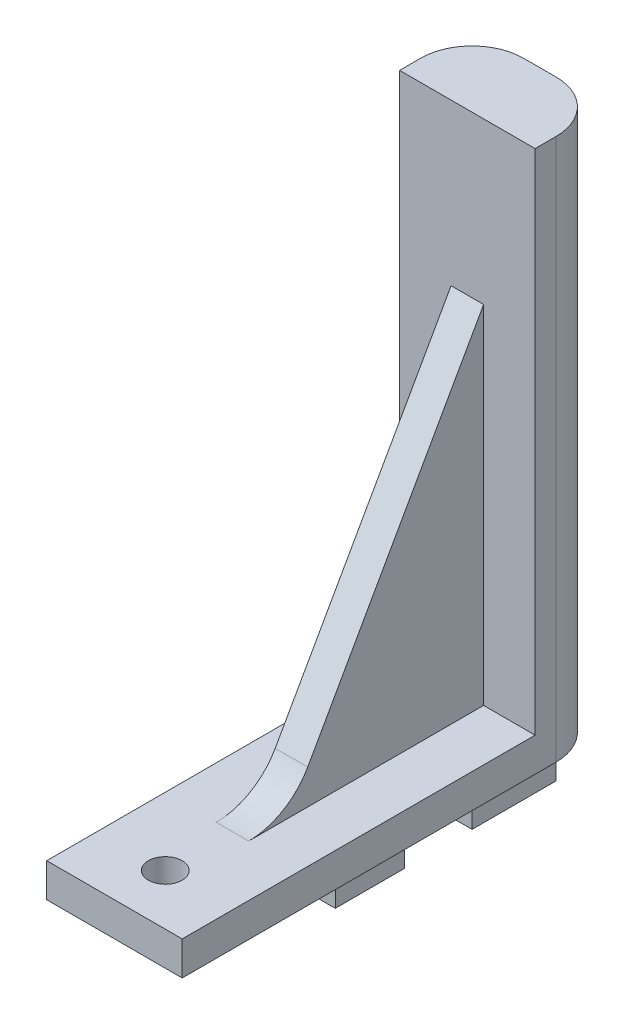
ISO-10303-21;
HEADER;
FILE_DESCRIPTION(('STEP AP214'),'2;1');
FILE_NAME('part.step','',(''),(''),'','','');
FILE_SCHEMA(('AUTOMOTIVE_DESIGN { 1 0 10303 214 1 1 1 1 }'));
ENDSEC;
DATA;
#1=APPLICATION_CONTEXT('core data for automotive mechanical design processes');
#2=APPLICATION_PROTOCOL_DEFINITION('international standard','automotive_design',2000,#1);
#3=PRODUCT_CONTEXT('',#1,'mechanical');
#4=PRODUCT('Part','Part','',(#3));
#5=PRODUCT_RELATED_PRODUCT_CATEGORY('part','',(#4));
#6=PRODUCT_DEFINITION_FORMATION('','',#4);
#7=PRODUCT_DEFINITION_CONTEXT('part definition',#1,'design');
#8=PRODUCT_DEFINITION('design','',#6,#7);
#9=PRODUCT_DEFINITION_SHAPE('','',#8);
#10=(LENGTH_UNIT() NAMED_UNIT(*) SI_UNIT(.MILLI.,.METRE.));
#11=(NAMED_UNIT(*) PLANE_ANGLE_UNIT() SI_UNIT($,.RADIAN.));
#12=(NAMED_UNIT(*) SI_UNIT($,.STERADIAN.) SOLID_ANGLE_UNIT());
#13=UNCERTAINTY_MEASURE_WITH_UNIT(LENGTH_MEASURE(1.E-05),#10,'distance_accuracy_value','');
#14=(GEOMETRIC_REPRESENTATION_CONTEXT(3) GLOBAL_UNCERTAINTY_ASSIGNED_CONTEXT((#13)) GLOBAL_UNIT_ASSIGNED_CONTEXT((#10,
#11,#12)) REPRESENTATION_CONTEXT('',''));
#15=CARTESIAN_POINT('',(0.,0.,0.));
#16=DIRECTION('',(0.,0.,1.));
#17=DIRECTION('',(1.,0.,0.));
#18=AXIS2_PLACEMENT_3D('',#15,#16,#17);
#19=CARTESIAN_POINT('',(6.35,2.97112168207122,5.28199410145995));
#20=DIRECTION('',(0.,-0.490261239632559,-0.871575537124549));
#21=DIRECTION('',(0.,0.871575537124549,-0.490261239632559));
#22=AXIS2_PLACEMENT_3D('',#19,#20,#21);
#23=PLANE('',#22);
#24=DIRECTION('',(0.,0.871575537124549,-0.490261239632559));
#25=VECTOR('',#24,1.);
#26=CARTESIAN_POINT('',(-1.524,2.97112168207122,5.28199410145995));
#27=LINE('',#26,#25);
#28=CARTESIAN_POINT('',(-1.524,6.41184112833326,3.34658941293755));
#29=VERTEX_POINT('',#28);
#30=CARTESIAN_POINT('',(-1.524,35.729333418,-13.1445));
#31=VERTEX_POINT('',#30);
#32=EDGE_CURVE('E213',#29,#31,#27,.T.);
#33=ORIENTED_EDGE('',*,*,#32,.F.);
#34=DIRECTION('',(-1.,0.,0.));
#35=VECTOR('',#34,1.);
#36=CARTESIAN_POINT('',(6.35,6.41184112833326,3.34658941293755));
#37=LINE('',#36,#35);
#38=CARTESIAN_POINT('',(1.524,6.41184112833326,3.34658941293755));
#39=VERTEX_POINT('',#38);
#40=EDGE_CURVE('E325',#29,#39,#37,.F.);
#41=ORIENTED_EDGE('',*,*,#40,.T.);
#42=DIRECTION('',(0.,0.871575537124549,-0.490261239632559));
#43=VECTOR('',#42,1.);
#44=CARTESIAN_POINT('',(1.524,2.97112168207122,5.28199410145995));
#45=LINE('',#44,#43);
#46=CARTESIAN_POINT('',(1.524,35.729333418,-13.1445));
#47=VERTEX_POINT('',#46);
#48=EDGE_CURVE('E54',#39,#47,#45,.T.);
#49=ORIENTED_EDGE('',*,*,#48,.T.);
#50=DIRECTION('',(-1.,0.,0.));
#51=VECTOR('',#50,1.);
#52=CARTESIAN_POINT('',(6.35,35.729333418,-13.1445));
#53=LINE('',#52,#51);
#54=EDGE_CURVE('E301',#47,#31,#53,.T.);
#55=ORIENTED_EDGE('',*,*,#54,.T.);
#56=EDGE_LOOP('',(#33,#41,#49,#55));
#57=FACE_BOUND('',#56,.T.);
#58=ADVANCED_FACE('F39',(#57),#23,.F.);
#59=CARTESIAN_POINT('',(-6.35,0.,0.));
#60=DIRECTION('',(1.,0.,0.));
#61=DIRECTION('',(0.,0.,-1.));
#62=AXIS2_PLACEMENT_3D('',#59,#60,#61);
#63=PLANE('',#62);
#64=DIRECTION('',(0.,0.,1.));
#65=VECTOR('',#64,1.);
#66=CARTESIAN_POINT('',(-6.35,3.17500000000002,0.));
#67=LINE('',#66,#65);
#68=CARTESIAN_POINT('',(-6.35,3.17500000000003,-13.1445));
#69=VERTEX_POINT('',#68);
#70=CARTESIAN_POINT('',(-6.35,3.175,19.939));
#71=VERTEX_POINT('',#70);
#72=EDGE_CURVE('E183',#69,#71,#67,.T.);
#73=ORIENTED_EDGE('',*,*,#72,.F.);
#74=DIRECTION('',(0.,1.,0.));
#75=VECTOR('',#74,1.);
#76=CARTESIAN_POINT('',(-6.35,0.,-13.1445));
#77=LINE('',#76,#75);
#78=CARTESIAN_POINT('',(-6.35,50.8,-13.1445));
#79=VERTEX_POINT('',#78);
#80=EDGE_CURVE('E171',#69,#79,#77,.T.);
#81=ORIENTED_EDGE('',*,*,#80,.T.);
#82=DIRECTION('',(0.,0.,1.));
#83=VECTOR('',#82,1.);
#84=CARTESIAN_POINT('',(-6.35,50.8,0.));
#85=LINE('',#84,#83);
#86=CARTESIAN_POINT('',(-6.35,50.8,-15.113));
#87=VERTEX_POINT('',#86);
#88=EDGE_CURVE('E279',#87,#79,#85,.T.);
#89=ORIENTED_EDGE('',*,*,#88,.F.);
#90=DIRECTION('',(0.,1.,0.));
#91=VECTOR('',#90,1.);
#92=CARTESIAN_POINT('',(-6.35,0.,-15.113));
#93=LINE('',#92,#91);
#94=CARTESIAN_POINT('',(-6.35,0.,-15.113));
#95=VERTEX_POINT('',#94);
#96=EDGE_CURVE('E315',#87,#95,#93,.F.);
#97=ORIENTED_EDGE('',*,*,#96,.T.);
#98=DIRECTION('',(0.,0.,-1.));
#99=VECTOR('',#98,1.);
#100=CARTESIAN_POINT('',(-6.35,0.,0.));
#101=LINE('',#100,#99);
#102=CARTESIAN_POINT('',(-6.35,0.,19.939));
#103=VERTEX_POINT('',#102);
#104=EDGE_CURVE('E289',#103,#95,#101,.T.);
#105=ORIENTED_EDGE('',*,*,#104,.F.);
#106=DIRECTION('',(0.,1.,0.));
#107=VECTOR('',#106,1.);
#108=CARTESIAN_POINT('',(-6.35,0.,19.939));
#109=LINE('',#108,#107);
#110=EDGE_CURVE('E191',#103,#71,#109,.T.);
#111=ORIENTED_EDGE('',*,*,#110,.T.);
#112=EDGE_LOOP('',(#73,#81,#89,#97,#105,#111));
#113=FACE_BOUND('',#112,.T.);
#114=ADVANCED_FACE('F188',(#113),#63,.F.);
#115=CARTESIAN_POINT('',(6.35,9.52500000000001,8.88109407367843));
#116=DIRECTION('',(1.,0.,0.));
#117=DIRECTION('',(0.,0.,-1.));
#118=AXIS2_PLACEMENT_3D('',#115,#116,#117);
#119=CYLINDRICAL_SURFACE('',#118,6.35);
#120=CARTESIAN_POINT('',(-1.524,9.52500000000001,8.88109407367843));
#121=DIRECTION('',(-1.,0.,0.));
#122=DIRECTION('',(0.,0.,1.));
#123=AXIS2_PLACEMENT_3D('',#120,#121,#122);
#124=CIRCLE('',#123,6.35);
#125=CARTESIAN_POINT('',(-1.524,3.17500000000001,8.88109407367843));
#126=VERTEX_POINT('',#125);
#127=EDGE_CURVE('E11',#126,#29,#124,.F.);
#128=ORIENTED_EDGE('',*,*,#127,.F.);
#129=DIRECTION('',(-1.,0.,0.));
#130=VECTOR('',#129,1.);
#131=CARTESIAN_POINT('',(-6.35,3.17500000000001,8.88109407367843));
#132=LINE('',#131,#130);
#133=CARTESIAN_POINT('',(1.524,3.17500000000001,8.88109407367843));
#134=VERTEX_POINT('',#133);
#135=EDGE_CURVE('E323',#134,#126,#132,.T.);
#136=ORIENTED_EDGE('',*,*,#135,.F.);
#137=CARTESIAN_POINT('',(1.524,9.52500000000001,8.88109407367843));
#138=DIRECTION('',(-1.,0.,0.));
#139=DIRECTION('',(0.,0.,1.));
#140=AXIS2_PLACEMENT_3D('',#137,#138,#139);
#141=CIRCLE('',#140,6.35);
#142=EDGE_CURVE('E47',#134,#39,#141,.F.);
#143=ORIENTED_EDGE('',*,*,#142,.T.);
#144=ORIENTED_EDGE('',*,*,#40,.F.);
#145=EDGE_LOOP('',(#128,#136,#143,#144));
#146=FACE_BOUND('',#145,.T.);
#147=ADVANCED_FACE('F41',(#146),#119,.F.);
#148=CARTESIAN_POINT('',(6.35,0.,0.));
#149=DIRECTION('',(0.,1.,0.));
#150=DIRECTION('',(0.,0.,1.));
#151=AXIS2_PLACEMENT_3D('',#148,#149,#150);
#152=PLANE('',#151);
#153=CARTESIAN_POINT('',(0.,0.,15.1765));
#154=DIRECTION('',(0.,-1.,0.));
#155=DIRECTION('',(0.,0.,-1.));
#156=AXIS2_PLACEMENT_3D('',#153,#154,#155);
#157=CIRCLE('',#156,1.5875);
#158=CARTESIAN_POINT('',(0.,0.,13.589));
#159=VERTEX_POINT('',#158);
#160=EDGE_CURVE('E215',#159,#159,#157,.T.);
#161=ORIENTED_EDGE('',*,*,#160,.F.);
#162=EDGE_LOOP('',(#161));
#163=FACE_BOUND('',#162,.T.);
#164=DIRECTION('',(-1.,0.,0.));
#165=VECTOR('',#164,1.);
#166=CARTESIAN_POINT('',(1.524,0.,0.762));
#167=LINE('',#166,#165);
#168=CARTESIAN_POINT('',(1.524,0.,0.762));
#169=VERTEX_POINT('',#168);
#170=CARTESIAN_POINT('',(-1.524,0.,0.762));
#171=VERTEX_POINT('',#170);
#172=EDGE_CURVE('E244',#169,#171,#167,.T.);
#173=ORIENTED_EDGE('',*,*,#172,.F.);
#174=DIRECTION('',(0.,0.,-1.));
#175=VECTOR('',#174,1.);
#176=CARTESIAN_POINT('',(1.524,0.,0.));
#177=LINE('',#176,#175);
#178=CARTESIAN_POINT('',(1.524,0.,-5.715));
#179=VERTEX_POINT('',#178);
#180=EDGE_CURVE('E222',#169,#179,#177,.T.);
#181=ORIENTED_EDGE('',*,*,#180,.T.);
#182=DIRECTION('',(-1.,0.,0.));
#183=VECTOR('',#182,1.);
#184=CARTESIAN_POINT('',(1.524,0.,-5.715));
#185=LINE('',#184,#183);
#186=CARTESIAN_POINT('',(-1.524,0.,-5.715));
#187=VERTEX_POINT('',#186);
#188=EDGE_CURVE('E247',#179,#187,#185,.T.);
#189=ORIENTED_EDGE('',*,*,#188,.T.);
#190=DIRECTION('',(0.,0.,-1.));
#191=VECTOR('',#190,1.);
#192=CARTESIAN_POINT('',(-1.524,0.,0.));
#193=LINE('',#192,#191);
#194=EDGE_CURVE('E233',#171,#187,#193,.T.);
#195=ORIENTED_EDGE('',*,*,#194,.F.);
#196=EDGE_LOOP('',(#173,#181,#189,#195));
#197=FACE_BOUND('',#196,.T.);
#198=ORIENTED_EDGE('',*,*,#104,.T.);
#199=CARTESIAN_POINT('',(-1.524,0.,-15.113));
#200=DIRECTION('',(0.,1.,0.));
#201=DIRECTION('',(0.,0.,1.));
#202=AXIS2_PLACEMENT_3D('',#199,#200,#201);
#203=CIRCLE('',#202,4.826);
#204=CARTESIAN_POINT('',(-1.524,0.,-19.939));
#205=VERTEX_POINT('',#204);
#206=EDGE_CURVE('E318',#95,#205,#203,.F.);
#207=ORIENTED_EDGE('',*,*,#206,.T.);
#208=DIRECTION('',(0.,0.,-1.));
#209=VECTOR('',#208,1.);
#210=CARTESIAN_POINT('',(-1.524,0.,0.));
#211=LINE('',#210,#209);
#212=CARTESIAN_POINT('',(-1.524,0.,-12.065));
#213=VERTEX_POINT('',#212);
#214=EDGE_CURVE('E249',#213,#205,#211,.T.);
#215=ORIENTED_EDGE('',*,*,#214,.F.);
#216=DIRECTION('',(-1.,0.,0.));
#217=VECTOR('',#216,1.);
#218=CARTESIAN_POINT('',(1.524,0.,-12.065));
#219=LINE('',#218,#217);
#220=CARTESIAN_POINT('',(1.524,0.,-12.065));
#221=VERTEX_POINT('',#220);
#222=EDGE_CURVE('E184',#221,#213,#219,.T.);
#223=ORIENTED_EDGE('',*,*,#222,.F.);
#224=DIRECTION('',(0.,0.,-1.));
#225=VECTOR('',#224,1.);
#226=CARTESIAN_POINT('',(1.524,0.,0.));
#227=LINE('',#226,#225);
#228=CARTESIAN_POINT('',(1.524,0.,-19.939));
#229=VERTEX_POINT('',#228);
#230=EDGE_CURVE('E250',#221,#229,#227,.T.);
#231=ORIENTED_EDGE('',*,*,#230,.T.);
#232=CARTESIAN_POINT('',(1.524,0.,-15.113));
#233=DIRECTION('',(0.,1.,0.));
#234=DIRECTION('',(0.,0.,1.));
#235=AXIS2_PLACEMENT_3D('',#232,#233,#234);
#236=CIRCLE('',#235,4.826);
#237=CARTESIAN_POINT('',(6.35,0.,-15.113));
#238=VERTEX_POINT('',#237);
#239=EDGE_CURVE('E62',#229,#238,#236,.F.);
#240=ORIENTED_EDGE('',*,*,#239,.T.);
#241=DIRECTION('',(0.,0.,-1.));
#242=VECTOR('',#241,1.);
#243=CARTESIAN_POINT('',(6.35,0.,0.));
#244=LINE('',#243,#242);
#245=CARTESIAN_POINT('',(6.35,0.,19.939));
#246=VERTEX_POINT('',#245);
#247=EDGE_CURVE('E284',#246,#238,#244,.T.);
#248=ORIENTED_EDGE('',*,*,#247,.F.);
#249=DIRECTION('',(-1.,0.,0.));
#250=VECTOR('',#249,1.);
#251=CARTESIAN_POINT('',(6.35,0.,19.939));
#252=LINE('',#251,#250);
#253=EDGE_CURVE('E297',#246,#103,#252,.T.);
#254=ORIENTED_EDGE('',*,*,#253,.T.);
#255=EDGE_LOOP('',(#198,#207,#215,#223,#231,#240,#248,#254));
#256=FACE_BOUND('',#255,.T.);
#257=ADVANCED_FACE('F353',(#163,#197,#256),#152,.F.);
#258=CARTESIAN_POINT('',(6.35,0.,-13.1445));
#259=DIRECTION('',(0.,0.,1.));
#260=DIRECTION('',(1.,0.,0.));
#261=AXIS2_PLACEMENT_3D('',#258,#259,#260);
#262=PLANE('',#261);
#263=DIRECTION('',(0.,1.,0.));
#264=VECTOR('',#263,1.);
#265=CARTESIAN_POINT('',(-1.524,-30.2586394705991,-13.1445));
#266=LINE('',#265,#264);
#267=CARTESIAN_POINT('',(-1.524,3.17500000000003,-13.1445));
#268=VERTEX_POINT('',#267);
#269=EDGE_CURVE('E199',#268,#31,#266,.T.);
#270=ORIENTED_EDGE('',*,*,#269,.T.);
#271=ORIENTED_EDGE('',*,*,#54,.F.);
#272=DIRECTION('',(0.,1.,0.));
#273=VECTOR('',#272,1.);
#274=CARTESIAN_POINT('',(1.524,-30.2586394705991,-13.1445));
#275=LINE('',#274,#273);
#276=CARTESIAN_POINT('',(1.524,3.17500000000003,-13.1445));
#277=VERTEX_POINT('',#276);
#278=EDGE_CURVE('E202',#277,#47,#275,.T.);
#279=ORIENTED_EDGE('',*,*,#278,.F.);
#280=DIRECTION('',(1.,0.,0.));
#281=VECTOR('',#280,1.);
#282=CARTESIAN_POINT('',(0.,3.17500000000003,-13.1445));
#283=LINE('',#282,#281);
#284=CARTESIAN_POINT('',(6.35,3.17500000000003,-13.1445));
#285=VERTEX_POINT('',#284);
#286=EDGE_CURVE('E208',#277,#285,#283,.T.);
#287=ORIENTED_EDGE('',*,*,#286,.T.);
#288=DIRECTION('',(0.,1.,0.));
#289=VECTOR('',#288,1.);
#290=CARTESIAN_POINT('',(6.35,0.,-13.1445));
#291=LINE('',#290,#289);
#292=CARTESIAN_POINT('',(6.35,50.8,-13.1445));
#293=VERTEX_POINT('',#292);
#294=EDGE_CURVE('E276',#285,#293,#291,.T.);
#295=ORIENTED_EDGE('',*,*,#294,.T.);
#296=DIRECTION('',(-1.,0.,0.));
#297=VECTOR('',#296,1.);
#298=CARTESIAN_POINT('',(6.35,50.8,-13.1445));
#299=LINE('',#298,#297);
#300=EDGE_CURVE('E179',#293,#79,#299,.T.);
#301=ORIENTED_EDGE('',*,*,#300,.T.);
#302=ORIENTED_EDGE('',*,*,#80,.F.);
#303=DIRECTION('',(1.,0.,0.));
#304=VECTOR('',#303,1.);
#305=CARTESIAN_POINT('',(0.,3.17500000000003,-13.1445));
#306=LINE('',#305,#304);
#307=EDGE_CURVE('E176',#69,#268,#306,.T.);
#308=ORIENTED_EDGE('',*,*,#307,.T.);
#309=EDGE_LOOP('',(#270,#271,#279,#287,#295,#301,#302,#308));
#310=FACE_BOUND('',#309,.T.);
#311=ADVANCED_FACE('F174',(#310),#262,.T.);
#312=CARTESIAN_POINT('',(6.35,3.17500000000002,0.));
#313=DIRECTION('',(0.,-1.,0.));
#314=DIRECTION('',(0.,0.,-1.));
#315=AXIS2_PLACEMENT_3D('',#312,#313,#314);
#316=PLANE('',#315);
#317=CARTESIAN_POINT('',(0.,3.175,15.1765));
#318=DIRECTION('',(0.,-1.,0.));
#319=DIRECTION('',(0.,0.,-1.));
#320=AXIS2_PLACEMENT_3D('',#317,#318,#319);
#321=CIRCLE('',#320,1.5875);
#322=CARTESIAN_POINT('',(0.,3.17500000000001,13.589));
#323=VERTEX_POINT('',#322);
#324=EDGE_CURVE('E218',#323,#323,#321,.T.);
#325=ORIENTED_EDGE('',*,*,#324,.T.);
#326=EDGE_LOOP('',(#325));
#327=FACE_BOUND('',#326,.T.);
#328=ORIENTED_EDGE('',*,*,#72,.T.);
#329=DIRECTION('',(-1.,0.,0.));
#330=VECTOR('',#329,1.);
#331=CARTESIAN_POINT('',(6.35,3.175,19.939));
#332=LINE('',#331,#330);
#333=CARTESIAN_POINT('',(6.35,3.175,19.939));
#334=VERTEX_POINT('',#333);
#335=EDGE_CURVE('E299',#334,#71,#332,.T.);
#336=ORIENTED_EDGE('',*,*,#335,.F.);
#337=DIRECTION('',(0.,0.,1.));
#338=VECTOR('',#337,1.);
#339=CARTESIAN_POINT('',(6.35,3.17500000000002,0.));
#340=LINE('',#339,#338);
#341=EDGE_CURVE('E278',#285,#334,#340,.T.);
#342=ORIENTED_EDGE('',*,*,#341,.F.);
#343=ORIENTED_EDGE('',*,*,#286,.F.);
#344=DIRECTION('',(0.,0.,1.));
#345=VECTOR('',#344,1.);
#346=CARTESIAN_POINT('',(1.524,3.17500000000002,0.));
#347=LINE('',#346,#345);
#348=EDGE_CURVE('E205',#277,#134,#347,.T.);
#349=ORIENTED_EDGE('',*,*,#348,.T.);
#350=ORIENTED_EDGE('',*,*,#135,.T.);
#351=DIRECTION('',(0.,0.,1.));
#352=VECTOR('',#351,1.);
#353=CARTESIAN_POINT('',(-1.524,3.17500000000002,0.));
#354=LINE('',#353,#352);
#355=EDGE_CURVE('E198',#268,#126,#354,.T.);
#356=ORIENTED_EDGE('',*,*,#355,.F.);
#357=ORIENTED_EDGE('',*,*,#307,.F.);
#358=EDGE_LOOP('',(#328,#336,#342,#343,#349,#350,#356,#357));
#359=FACE_BOUND('',#358,.T.);
#360=ADVANCED_FACE('F196',(#327,#359),#316,.F.);
#361=CARTESIAN_POINT('',(6.35,0.,19.939));
#362=DIRECTION('',(0.,0.,1.));
#363=DIRECTION('',(0.,-1.,0.));
#364=AXIS2_PLACEMENT_3D('',#361,#362,#363);
#365=PLANE('',#364);
#366=ORIENTED_EDGE('',*,*,#110,.F.);
#367=ORIENTED_EDGE('',*,*,#253,.F.);
#368=DIRECTION('',(0.,1.,0.));
#369=VECTOR('',#368,1.);
#370=CARTESIAN_POINT('',(6.35,0.,19.939));
#371=LINE('',#370,#369);
#372=EDGE_CURVE('E281',#246,#334,#371,.T.);
#373=ORIENTED_EDGE('',*,*,#372,.T.);
#374=ORIENTED_EDGE('',*,*,#335,.T.);
#375=EDGE_LOOP('',(#366,#367,#373,#374));
#376=FACE_BOUND('',#375,.T.);
#377=ADVANCED_FACE('F451',(#376),#365,.T.);
#378=CARTESIAN_POINT('',(6.35,0.,-19.939));
#379=DIRECTION('',(0.,0.,1.));
#380=DIRECTION('',(1.,0.,0.));
#381=AXIS2_PLACEMENT_3D('',#378,#379,#380);
#382=PLANE('',#381);
#383=DIRECTION('',(0.,-1.,0.));
#384=VECTOR('',#383,1.);
#385=CARTESIAN_POINT('',(-1.524,0.,-19.939));
#386=LINE('',#385,#384);
#387=CARTESIAN_POINT('',(-1.524,-6.34999999999996,-19.939));
#388=VERTEX_POINT('',#387);
#389=EDGE_CURVE('E253',#205,#388,#386,.T.);
#390=ORIENTED_EDGE('',*,*,#389,.F.);
#391=DIRECTION('',(0.,1.,0.));
#392=VECTOR('',#391,1.);
#393=CARTESIAN_POINT('',(-1.524,0.,-19.939));
#394=LINE('',#393,#392);
#395=CARTESIAN_POINT('',(-1.524,50.8,-19.939));
#396=VERTEX_POINT('',#395);
#397=EDGE_CURVE('E308',#205,#396,#394,.T.);
#398=ORIENTED_EDGE('',*,*,#397,.T.);
#399=DIRECTION('',(-1.,0.,0.));
#400=VECTOR('',#399,1.);
#401=CARTESIAN_POINT('',(6.35,50.8,-19.939));
#402=LINE('',#401,#400);
#403=CARTESIAN_POINT('',(1.524,50.8,-19.939));
#404=VERTEX_POINT('',#403);
#405=EDGE_CURVE('E294',#404,#396,#402,.T.);
#406=ORIENTED_EDGE('',*,*,#405,.F.);
#407=DIRECTION('',(0.,1.,0.));
#408=VECTOR('',#407,1.);
#409=CARTESIAN_POINT('',(1.524,0.,-19.939));
#410=LINE('',#409,#408);
#411=EDGE_CURVE('E304',#404,#229,#410,.F.);
#412=ORIENTED_EDGE('',*,*,#411,.T.);
#413=DIRECTION('',(0.,-1.,0.));
#414=VECTOR('',#413,1.);
#415=CARTESIAN_POINT('',(1.524,0.,-19.939));
#416=LINE('',#415,#414);
#417=CARTESIAN_POINT('',(1.524,-6.34999999999996,-19.939));
#418=VERTEX_POINT('',#417);
#419=EDGE_CURVE('E258',#229,#418,#416,.T.);
#420=ORIENTED_EDGE('',*,*,#419,.T.);
#421=DIRECTION('',(-1.,0.,0.));
#422=VECTOR('',#421,1.);
#423=CARTESIAN_POINT('',(1.524,-6.34999999999996,-19.939));
#424=LINE('',#423,#422);
#425=EDGE_CURVE('E261',#418,#388,#424,.T.);
#426=ORIENTED_EDGE('',*,*,#425,.T.);
#427=EDGE_LOOP('',(#390,#398,#406,#412,#420,#426));
#428=FACE_BOUND('',#427,.T.);
#429=ADVANCED_FACE('F360',(#428),#382,.F.);
#430=CARTESIAN_POINT('',(6.35,50.8,0.));
#431=DIRECTION('',(0.,-1.,0.));
#432=DIRECTION('',(0.,0.,-1.));
#433=AXIS2_PLACEMENT_3D('',#430,#431,#432);
#434=PLANE('',#433);
#435=ORIENTED_EDGE('',*,*,#405,.T.);
#436=CARTESIAN_POINT('',(-1.524,50.8,-15.113));
#437=DIRECTION('',(0.,-1.,0.));
#438=DIRECTION('',(0.,0.,-1.));
#439=AXIS2_PLACEMENT_3D('',#436,#437,#438);
#440=CIRCLE('',#439,4.826);
#441=EDGE_CURVE('E313',#396,#87,#440,.F.);
#442=ORIENTED_EDGE('',*,*,#441,.T.);
#443=ORIENTED_EDGE('',*,*,#88,.T.);
#444=ORIENTED_EDGE('',*,*,#300,.F.);
#445=DIRECTION('',(0.,0.,1.));
#446=VECTOR('',#445,1.);
#447=CARTESIAN_POINT('',(6.35,50.8,0.));
#448=LINE('',#447,#446);
#449=CARTESIAN_POINT('',(6.35,50.8,-15.113));
#450=VERTEX_POINT('',#449);
#451=EDGE_CURVE('E286',#450,#293,#448,.T.);
#452=ORIENTED_EDGE('',*,*,#451,.F.);
#453=CARTESIAN_POINT('',(1.524,50.8,-15.113));
#454=DIRECTION('',(0.,-1.,0.));
#455=DIRECTION('',(0.,0.,-1.));
#456=AXIS2_PLACEMENT_3D('',#453,#454,#455);
#457=CIRCLE('',#456,4.826);
#458=EDGE_CURVE('E311',#450,#404,#457,.F.);
#459=ORIENTED_EDGE('',*,*,#458,.T.);
#460=EDGE_LOOP('',(#435,#442,#443,#444,#452,#459));
#461=FACE_BOUND('',#460,.T.);
#462=ADVANCED_FACE('F346',(#461),#434,.F.);
#463=CARTESIAN_POINT('',(6.35,0.,0.));
#464=DIRECTION('',(1.,0.,0.));
#465=DIRECTION('',(0.,0.,-1.));
#466=AXIS2_PLACEMENT_3D('',#463,#464,#465);
#467=PLANE('',#466);
#468=ORIENTED_EDGE('',*,*,#294,.F.);
#469=ORIENTED_EDGE('',*,*,#341,.T.);
#470=ORIENTED_EDGE('',*,*,#372,.F.);
#471=ORIENTED_EDGE('',*,*,#247,.T.);
#472=DIRECTION('',(0.,1.,0.));
#473=VECTOR('',#472,1.);
#474=CARTESIAN_POINT('',(6.35,50.8,-15.113));
#475=LINE('',#474,#473);
#476=EDGE_CURVE('E320',#238,#450,#475,.T.);
#477=ORIENTED_EDGE('',*,*,#476,.T.);
#478=ORIENTED_EDGE('',*,*,#451,.T.);
#479=EDGE_LOOP('',(#468,#469,#470,#471,#477,#478));
#480=FACE_BOUND('',#479,.T.);
#481=ADVANCED_FACE('F342',(#480),#467,.T.);
#482=CARTESIAN_POINT('',(1.524,0.,-12.065));
#483=DIRECTION('',(0.,0.,-1.));
#484=DIRECTION('',(0.,1.,0.));
#485=AXIS2_PLACEMENT_3D('',#482,#483,#484);
#486=PLANE('',#485);
#487=DIRECTION('',(0.,-1.,0.));
#488=VECTOR('',#487,1.);
#489=CARTESIAN_POINT('',(-1.524,0.,-12.065));
#490=LINE('',#489,#488);
#491=CARTESIAN_POINT('',(-1.524,-6.34999999999996,-12.065));
#492=VERTEX_POINT('',#491);
#493=EDGE_CURVE('E264',#213,#492,#490,.T.);
#494=ORIENTED_EDGE('',*,*,#493,.T.);
#495=DIRECTION('',(-1.,0.,0.));
#496=VECTOR('',#495,1.);
#497=CARTESIAN_POINT('',(1.524,-6.34999999999996,-12.065));
#498=LINE('',#497,#496);
#499=CARTESIAN_POINT('',(1.524,-6.34999999999996,-12.065));
#500=VERTEX_POINT('',#499);
#501=EDGE_CURVE('E273',#500,#492,#498,.T.);
#502=ORIENTED_EDGE('',*,*,#501,.F.);
#503=DIRECTION('',(0.,-1.,0.));
#504=VECTOR('',#503,1.);
#505=CARTESIAN_POINT('',(1.524,0.,-12.065));
#506=LINE('',#505,#504);
#507=EDGE_CURVE('E252',#221,#500,#506,.T.);
#508=ORIENTED_EDGE('',*,*,#507,.F.);
#509=ORIENTED_EDGE('',*,*,#222,.T.);
#510=EDGE_LOOP('',(#494,#502,#508,#509));
#511=FACE_BOUND('',#510,.T.);
#512=ADVANCED_FACE('F369',(#511),#486,.F.);
#513=CARTESIAN_POINT('',(1.524,-6.34999999999997,0.));
#514=DIRECTION('',(0.,-1.,0.));
#515=DIRECTION('',(0.,0.,-1.));
#516=AXIS2_PLACEMENT_3D('',#513,#514,#515);
#517=PLANE('',#516);
#518=DIRECTION('',(0.,0.,1.));
#519=VECTOR('',#518,1.);
#520=CARTESIAN_POINT('',(-1.524,-6.34999999999997,0.));
#521=LINE('',#520,#519);
#522=EDGE_CURVE('E267',#388,#492,#521,.T.);
#523=ORIENTED_EDGE('',*,*,#522,.F.);
#524=ORIENTED_EDGE('',*,*,#425,.F.);
#525=DIRECTION('',(0.,0.,1.));
#526=VECTOR('',#525,1.);
#527=CARTESIAN_POINT('',(1.524,-6.34999999999997,0.));
#528=LINE('',#527,#526);
#529=EDGE_CURVE('E255',#418,#500,#528,.T.);
#530=ORIENTED_EDGE('',*,*,#529,.T.);
#531=ORIENTED_EDGE('',*,*,#501,.T.);
#532=EDGE_LOOP('',(#523,#524,#530,#531));
#533=FACE_BOUND('',#532,.T.);
#534=ADVANCED_FACE('F366',(#533),#517,.T.);
#535=CARTESIAN_POINT('',(1.524,0.,0.));
#536=DIRECTION('',(1.,0.,0.));
#537=DIRECTION('',(0.,0.,-1.));
#538=AXIS2_PLACEMENT_3D('',#535,#536,#537);
#539=PLANE('',#538);
#540=ORIENTED_EDGE('',*,*,#230,.F.);
#541=ORIENTED_EDGE('',*,*,#507,.T.);
#542=ORIENTED_EDGE('',*,*,#529,.F.);
#543=ORIENTED_EDGE('',*,*,#419,.F.);
#544=EDGE_LOOP('',(#540,#541,#542,#543));
#545=FACE_BOUND('',#544,.T.);
#546=ADVANCED_FACE('F375',(#545),#539,.T.);
#547=CARTESIAN_POINT('',(-1.524,0.,0.));
#548=DIRECTION('',(1.,0.,0.));
#549=DIRECTION('',(0.,0.,-1.));
#550=AXIS2_PLACEMENT_3D('',#547,#548,#549);
#551=PLANE('',#550);
#552=ORIENTED_EDGE('',*,*,#214,.T.);
#553=ORIENTED_EDGE('',*,*,#389,.T.);
#554=ORIENTED_EDGE('',*,*,#522,.T.);
#555=ORIENTED_EDGE('',*,*,#493,.F.);
#556=EDGE_LOOP('',(#552,#553,#554,#555));
#557=FACE_BOUND('',#556,.T.);
#558=ADVANCED_FACE('F358',(#557),#551,.F.);
#559=CARTESIAN_POINT('',(1.524,0.,-5.715));
#560=DIRECTION('',(0.,0.,-1.));
#561=DIRECTION('',(-1.,0.,0.));
#562=AXIS2_PLACEMENT_3D('',#559,#560,#561);
#563=PLANE('',#562);
#564=DIRECTION('',(0.,-1.,0.));
#565=VECTOR('',#564,1.);
#566=CARTESIAN_POINT('',(-1.524,0.,-5.715));
#567=LINE('',#566,#565);
#568=CARTESIAN_POINT('',(-1.524,-6.34999999999997,-5.715));
#569=VERTEX_POINT('',#568);
#570=EDGE_CURVE('E230',#187,#569,#567,.T.);
#571=ORIENTED_EDGE('',*,*,#570,.F.);
#572=ORIENTED_EDGE('',*,*,#188,.F.);
#573=DIRECTION('',(0.,-1.,0.));
#574=VECTOR('',#573,1.);
#575=CARTESIAN_POINT('',(1.524,0.,-5.715));
#576=LINE('',#575,#574);
#577=CARTESIAN_POINT('',(1.524,-6.34999999999997,-5.715));
#578=VERTEX_POINT('',#577);
#579=EDGE_CURVE('E219',#179,#578,#576,.T.);
#580=ORIENTED_EDGE('',*,*,#579,.T.);
#581=DIRECTION('',(-1.,0.,0.));
#582=VECTOR('',#581,1.);
#583=CARTESIAN_POINT('',(1.524,-6.34999999999997,-5.715));
#584=LINE('',#583,#582);
#585=EDGE_CURVE('E229',#578,#569,#584,.T.);
#586=ORIENTED_EDGE('',*,*,#585,.T.);
#587=EDGE_LOOP('',(#571,#572,#580,#586));
#588=FACE_BOUND('',#587,.T.);
#589=ADVANCED_FACE('F382',(#588),#563,.T.);
#590=CARTESIAN_POINT('',(1.524,0.,0.762));
#591=DIRECTION('',(0.,0.,-1.));
#592=DIRECTION('',(0.,1.,0.));
#593=AXIS2_PLACEMENT_3D('',#590,#591,#592);
#594=PLANE('',#593);
#595=DIRECTION('',(0.,-1.,0.));
#596=VECTOR('',#595,1.);
#597=CARTESIAN_POINT('',(-1.524,0.,0.762));
#598=LINE('',#597,#596);
#599=CARTESIAN_POINT('',(-1.524,-6.34999999999997,0.761999999999999));
#600=VERTEX_POINT('',#599);
#601=EDGE_CURVE('E236',#171,#600,#598,.T.);
#602=ORIENTED_EDGE('',*,*,#601,.T.);
#603=DIRECTION('',(-1.,0.,0.));
#604=VECTOR('',#603,1.);
#605=CARTESIAN_POINT('',(1.524,-6.34999999999997,0.761999999999999));
#606=LINE('',#605,#604);
#607=CARTESIAN_POINT('',(1.524,-6.34999999999997,0.761999999999999));
#608=VERTEX_POINT('',#607);
#609=EDGE_CURVE('E241',#608,#600,#606,.T.);
#610=ORIENTED_EDGE('',*,*,#609,.F.);
#611=DIRECTION('',(0.,-1.,0.));
#612=VECTOR('',#611,1.);
#613=CARTESIAN_POINT('',(1.524,0.,0.762));
#614=LINE('',#613,#612);
#615=EDGE_CURVE('E225',#169,#608,#614,.T.);
#616=ORIENTED_EDGE('',*,*,#615,.F.);
#617=ORIENTED_EDGE('',*,*,#172,.T.);
#618=EDGE_LOOP('',(#602,#610,#616,#617));
#619=FACE_BOUND('',#618,.T.);
#620=ADVANCED_FACE('F423',(#619),#594,.F.);
#621=CARTESIAN_POINT('',(1.524,-6.34999999999997,0.));
#622=DIRECTION('',(0.,1.,0.));
#623=DIRECTION('',(0.,0.,1.));
#624=AXIS2_PLACEMENT_3D('',#621,#622,#623);
#625=PLANE('',#624);
#626=DIRECTION('',(0.,0.,-1.));
#627=VECTOR('',#626,1.);
#628=CARTESIAN_POINT('',(-1.524,-6.34999999999997,0.));
#629=LINE('',#628,#627);
#630=EDGE_CURVE('E223',#600,#569,#629,.T.);
#631=ORIENTED_EDGE('',*,*,#630,.T.);
#632=ORIENTED_EDGE('',*,*,#585,.F.);
#633=DIRECTION('',(0.,0.,-1.));
#634=VECTOR('',#633,1.);
#635=CARTESIAN_POINT('',(1.524,-6.34999999999997,0.));
#636=LINE('',#635,#634);
#637=EDGE_CURVE('E227',#608,#578,#636,.T.);
#638=ORIENTED_EDGE('',*,*,#637,.F.);
#639=ORIENTED_EDGE('',*,*,#609,.T.);
#640=EDGE_LOOP('',(#631,#632,#638,#639));
#641=FACE_BOUND('',#640,.T.);
#642=ADVANCED_FACE('F416',(#641),#625,.F.);
#643=CARTESIAN_POINT('',(1.524,0.,0.));
#644=DIRECTION('',(1.,0.,0.));
#645=DIRECTION('',(0.,0.,-1.));
#646=AXIS2_PLACEMENT_3D('',#643,#644,#645);
#647=PLANE('',#646);
#648=ORIENTED_EDGE('',*,*,#579,.F.);
#649=ORIENTED_EDGE('',*,*,#180,.F.);
#650=ORIENTED_EDGE('',*,*,#615,.T.);
#651=ORIENTED_EDGE('',*,*,#637,.T.);
#652=EDGE_LOOP('',(#648,#649,#650,#651));
#653=FACE_BOUND('',#652,.T.);
#654=ADVANCED_FACE('F413',(#653),#647,.T.);
#655=CARTESIAN_POINT('',(-1.524,0.,0.));
#656=DIRECTION('',(1.,0.,0.));
#657=DIRECTION('',(0.,0.,-1.));
#658=AXIS2_PLACEMENT_3D('',#655,#656,#657);
#659=PLANE('',#658);
#660=ORIENTED_EDGE('',*,*,#570,.T.);
#661=ORIENTED_EDGE('',*,*,#630,.F.);
#662=ORIENTED_EDGE('',*,*,#601,.F.);
#663=ORIENTED_EDGE('',*,*,#194,.T.);
#664=EDGE_LOOP('',(#660,#661,#662,#663));
#665=FACE_BOUND('',#664,.T.);
#666=ADVANCED_FACE('F411',(#665),#659,.F.);
#667=CARTESIAN_POINT('',(0.,50.8,15.1765));
#668=DIRECTION('',(0.,-1.,0.));
#669=DIRECTION('',(0.,0.,-1.));
#670=AXIS2_PLACEMENT_3D('',#667,#668,#669);
#671=CYLINDRICAL_SURFACE('',#670,1.5875);
#672=ORIENTED_EDGE('',*,*,#160,.T.);
#673=EDGE_LOOP('',(#672));
#674=FACE_BOUND('',#673,.T.);
#675=ORIENTED_EDGE('',*,*,#324,.F.);
#676=EDGE_LOOP('',(#675));
#677=FACE_BOUND('',#676,.T.);
#678=ADVANCED_FACE('F398',(#674,#677),#671,.F.);
#679=CARTESIAN_POINT('',(-1.524,0.,-15.113));
#680=DIRECTION('',(0.,1.,0.));
#681=DIRECTION('',(0.,0.,1.));
#682=AXIS2_PLACEMENT_3D('',#679,#680,#681);
#683=CYLINDRICAL_SURFACE('',#682,4.826);
#684=ORIENTED_EDGE('',*,*,#206,.F.);
#685=ORIENTED_EDGE('',*,*,#96,.F.);
#686=ORIENTED_EDGE('',*,*,#441,.F.);
#687=ORIENTED_EDGE('',*,*,#397,.F.);
#688=EDGE_LOOP('',(#684,#685,#686,#687));
#689=FACE_BOUND('',#688,.T.);
#690=ADVANCED_FACE('F350',(#689),#683,.T.);
#691=CARTESIAN_POINT('',(1.524,0.,-15.113));
#692=DIRECTION('',(0.,-1.,0.));
#693=DIRECTION('',(0.,0.,-1.));
#694=AXIS2_PLACEMENT_3D('',#691,#692,#693);
#695=CYLINDRICAL_SURFACE('',#694,4.826);
#696=ORIENTED_EDGE('',*,*,#239,.F.);
#697=ORIENTED_EDGE('',*,*,#411,.F.);
#698=ORIENTED_EDGE('',*,*,#458,.F.);
#699=ORIENTED_EDGE('',*,*,#476,.F.);
#700=EDGE_LOOP('',(#696,#697,#698,#699));
#701=FACE_BOUND('',#700,.T.);
#702=ADVANCED_FACE('F374',(#701),#695,.T.);
#703=CARTESIAN_POINT('',(1.524,-30.2586394705991,0.));
#704=DIRECTION('',(-1.,0.,0.));
#705=DIRECTION('',(0.,0.,1.));
#706=AXIS2_PLACEMENT_3D('',#703,#704,#705);
#707=PLANE('',#706);
#708=ORIENTED_EDGE('',*,*,#142,.F.);
#709=ORIENTED_EDGE('',*,*,#348,.F.);
#710=ORIENTED_EDGE('',*,*,#278,.T.);
#711=ORIENTED_EDGE('',*,*,#48,.F.);
#712=EDGE_LOOP('',(#708,#709,#710,#711));
#713=FACE_BOUND('',#712,.T.);
#714=ADVANCED_FACE('F338',(#713),#707,.F.);
#715=CARTESIAN_POINT('',(-1.524,-30.2586394705991,0.));
#716=DIRECTION('',(-1.,0.,0.));
#717=DIRECTION('',(0.,0.,1.));
#718=AXIS2_PLACEMENT_3D('',#715,#716,#717);
#719=PLANE('',#718);
#720=ORIENTED_EDGE('',*,*,#32,.T.);
#721=ORIENTED_EDGE('',*,*,#269,.F.);
#722=ORIENTED_EDGE('',*,*,#355,.T.);
#723=ORIENTED_EDGE('',*,*,#127,.T.);
#724=EDGE_LOOP('',(#720,#721,#722,#723));
#725=FACE_BOUND('',#724,.T.);
#726=ADVANCED_FACE('F335',(#725),#719,.T.);
#727=CLOSED_SHELL('',(#58,#114,#147,#257,#311,#360,#377,#429,#462,#481,#512,#534,#546,#558,#589,
#620,#642,#654,#666,#678,#690,#702,#714,#726));
#728=MANIFOLD_SOLID_BREP('B2',#727);
#729=ADVANCED_BREP_SHAPE_REPRESENTATION('',(#18,#728),#14);
#730=SHAPE_DEFINITION_REPRESENTATION(#9,#729);
ENDSEC;
END-ISO-10303-21;
